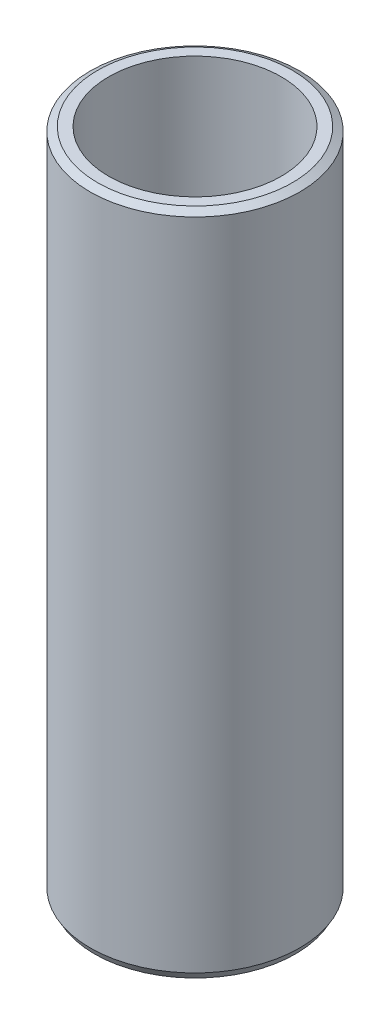
ISO-10303-21;
HEADER;
FILE_DESCRIPTION(('STEP AP214'),'2;1');
FILE_NAME('part.step','',(''),(''),'','','');
FILE_SCHEMA(('AUTOMOTIVE_DESIGN { 1 0 10303 214 1 1 1 1 }'));
ENDSEC;
DATA;
#1=APPLICATION_CONTEXT('core data for automotive mechanical design processes');
#2=APPLICATION_PROTOCOL_DEFINITION('international standard','automotive_design',2000,#1);
#3=PRODUCT_CONTEXT('',#1,'mechanical');
#4=PRODUCT('Part','Part','',(#3));
#5=PRODUCT_RELATED_PRODUCT_CATEGORY('part','',(#4));
#6=PRODUCT_DEFINITION_FORMATION('','',#4);
#7=PRODUCT_DEFINITION_CONTEXT('part definition',#1,'design');
#8=PRODUCT_DEFINITION('design','',#6,#7);
#9=PRODUCT_DEFINITION_SHAPE('','',#8);
#10=(LENGTH_UNIT() NAMED_UNIT(*) SI_UNIT(.MILLI.,.METRE.));
#11=(NAMED_UNIT(*) PLANE_ANGLE_UNIT() SI_UNIT($,.RADIAN.));
#12=(NAMED_UNIT(*) SI_UNIT($,.STERADIAN.) SOLID_ANGLE_UNIT());
#13=UNCERTAINTY_MEASURE_WITH_UNIT(LENGTH_MEASURE(1.E-05),#10,'distance_accuracy_value','');
#14=(GEOMETRIC_REPRESENTATION_CONTEXT(3) GLOBAL_UNCERTAINTY_ASSIGNED_CONTEXT((#13)) GLOBAL_UNIT_ASSIGNED_CONTEXT((#10,
#11,#12)) REPRESENTATION_CONTEXT('',''));
#15=CARTESIAN_POINT('',(0.,0.,0.));
#16=DIRECTION('',(0.,0.,1.));
#17=DIRECTION('',(1.,0.,0.));
#18=AXIS2_PLACEMENT_3D('',#15,#16,#17);
#19=CARTESIAN_POINT('',(0.,254.315129538956,0.));
#20=DIRECTION('',(0.,-1.,0.));
#21=DIRECTION('',(0.,0.,-1.));
#22=AXIS2_PLACEMENT_3D('',#19,#20,#21);
#23=CYLINDRICAL_SURFACE('',#22,40.);
#24=CARTESIAN_POINT('',(0.,252.680123687177,0.));
#25=DIRECTION('',(0.,1.,0.));
#26=DIRECTION('',(0.,0.,1.));
#27=AXIS2_PLACEMENT_3D('',#24,#25,#26);
#28=CIRCLE('',#27,40.);
#29=CARTESIAN_POINT('',(0.,252.680123687177,40.));
#30=VERTEX_POINT('',#29);
#31=EDGE_CURVE('E50',#30,#30,#28,.F.);
#32=ORIENTED_EDGE('',*,*,#31,.T.);
#33=EDGE_LOOP('',(#32));
#34=FACE_BOUND('',#33,.T.);
#35=CARTESIAN_POINT('',(0.,2.83191320595344,0.));
#36=DIRECTION('',(0.,1.,0.));
#37=DIRECTION('',(0.,0.,1.));
#38=AXIS2_PLACEMENT_3D('',#35,#36,#37);
#39=CIRCLE('',#38,40.);
#40=CARTESIAN_POINT('',(0.,2.83191320595344,40.));
#41=VERTEX_POINT('',#40);
#42=EDGE_CURVE('E51',#41,#41,#39,.T.);
#43=ORIENTED_EDGE('',*,*,#42,.T.);
#44=EDGE_LOOP('',(#43));
#45=FACE_BOUND('',#44,.T.);
#46=ADVANCED_FACE('F39',(#34,#45),#23,.T.);
#47=CARTESIAN_POINT('',(0.,254.315129538956,0.));
#48=DIRECTION('',(0.,1.,0.));
#49=DIRECTION('',(0.,0.,1.));
#50=AXIS2_PLACEMENT_3D('',#47,#48,#49);
#51=PLANE('',#50);
#52=CARTESIAN_POINT('',(0.,254.315129538956,0.));
#53=DIRECTION('',(0.,1.,0.));
#54=DIRECTION('',(0.,0.,1.));
#55=AXIS2_PLACEMENT_3D('',#52,#53,#54);
#56=CIRCLE('',#55,37.1680867940465);
#57=CARTESIAN_POINT('',(0.,254.315129538956,37.1680867940465));
#58=VERTEX_POINT('',#57);
#59=EDGE_CURVE('E54',#58,#58,#56,.T.);
#60=ORIENTED_EDGE('',*,*,#59,.T.);
#61=EDGE_LOOP('',(#60));
#62=FACE_BOUND('',#61,.T.);
#63=CARTESIAN_POINT('',(0.,254.315129538956,0.));
#64=DIRECTION('',(0.,1.,0.));
#65=DIRECTION('',(0.,0.,1.));
#66=AXIS2_PLACEMENT_3D('',#63,#64,#65);
#67=CIRCLE('',#66,32.9292470539236);
#68=CARTESIAN_POINT('',(0.,254.315129538956,32.9292470539236));
#69=VERTEX_POINT('',#68);
#70=EDGE_CURVE('E58',#69,#69,#67,.T.);
#71=ORIENTED_EDGE('',*,*,#70,.F.);
#72=EDGE_LOOP('',(#71));
#73=FACE_BOUND('',#72,.T.);
#74=ADVANCED_FACE('F69',(#62,#73),#51,.T.);
#75=CARTESIAN_POINT('',(0.,0.,0.));
#76=DIRECTION('',(0.,1.,0.));
#77=DIRECTION('',(0.,0.,1.));
#78=AXIS2_PLACEMENT_3D('',#75,#76,#77);
#79=PLANE('',#78);
#80=CARTESIAN_POINT('',(0.,0.,0.));
#81=DIRECTION('',(0.,1.,0.));
#82=DIRECTION('',(0.,0.,1.));
#83=AXIS2_PLACEMENT_3D('',#80,#81,#82);
#84=CIRCLE('',#83,38.3649941482211);
#85=CARTESIAN_POINT('',(0.,0.,38.3649941482211));
#86=VERTEX_POINT('',#85);
#87=EDGE_CURVE('E10',#86,#86,#84,.F.);
#88=ORIENTED_EDGE('',*,*,#87,.T.);
#89=EDGE_LOOP('',(#88));
#90=FACE_BOUND('',#89,.T.);
#91=CARTESIAN_POINT('',(0.,0.,0.));
#92=DIRECTION('',(0.,1.,0.));
#93=DIRECTION('',(0.,0.,1.));
#94=AXIS2_PLACEMENT_3D('',#91,#92,#93);
#95=CIRCLE('',#94,32.9292470539236);
#96=CARTESIAN_POINT('',(0.,0.,32.9292470539236));
#97=VERTEX_POINT('',#96);
#98=EDGE_CURVE('E63',#97,#97,#95,.T.);
#99=ORIENTED_EDGE('',*,*,#98,.T.);
#100=EDGE_LOOP('',(#99));
#101=FACE_BOUND('',#100,.T.);
#102=ADVANCED_FACE('F75',(#90,#101),#79,.F.);
#103=CARTESIAN_POINT('',(0.,254.315129538956,0.));
#104=DIRECTION('',(0.,-1.,0.));
#105=DIRECTION('',(0.,0.,-1.));
#106=AXIS2_PLACEMENT_3D('',#103,#104,#105);
#107=CYLINDRICAL_SURFACE('',#106,32.9292470539236);
#108=ORIENTED_EDGE('',*,*,#70,.T.);
#109=EDGE_LOOP('',(#108));
#110=FACE_BOUND('',#109,.T.);
#111=ORIENTED_EDGE('',*,*,#98,.F.);
#112=EDGE_LOOP('',(#111));
#113=FACE_BOUND('',#112,.T.);
#114=ADVANCED_FACE('F70',(#110,#113),#107,.F.);
#115=CARTESIAN_POINT('',(0.,254.315129538956,0.));
#116=DIRECTION('',(0.,-1.,0.));
#117=DIRECTION('',(0.,0.,-1.));
#118=AXIS2_PLACEMENT_3D('',#115,#116,#117);
#119=CONICAL_SURFACE('',#118,37.1680867940465,1.0471975511966);
#120=ORIENTED_EDGE('',*,*,#31,.F.);
#121=EDGE_LOOP('',(#120));
#122=FACE_BOUND('',#121,.T.);
#123=ORIENTED_EDGE('',*,*,#59,.F.);
#124=EDGE_LOOP('',(#123));
#125=FACE_BOUND('',#124,.T.);
#126=ADVANCED_FACE('F81',(#122,#125),#119,.T.);
#127=CARTESIAN_POINT('',(0.,2.83191320595344,0.));
#128=DIRECTION('',(0.,1.,0.));
#129=DIRECTION('',(0.,0.,1.));
#130=AXIS2_PLACEMENT_3D('',#127,#128,#129);
#131=CONICAL_SURFACE('',#130,40.,0.523598775598305);
#132=ORIENTED_EDGE('',*,*,#87,.F.);
#133=EDGE_LOOP('',(#132));
#134=FACE_BOUND('',#133,.T.);
#135=ORIENTED_EDGE('',*,*,#42,.F.);
#136=EDGE_LOOP('',(#135));
#137=FACE_BOUND('',#136,.T.);
#138=ADVANCED_FACE('F45',(#134,#137),#131,.T.);
#139=CLOSED_SHELL('',(#46,#74,#102,#114,#126,#138));
#140=MANIFOLD_SOLID_BREP('B2',#139);
#141=ADVANCED_BREP_SHAPE_REPRESENTATION('',(#18,#140),#14);
#142=SHAPE_DEFINITION_REPRESENTATION(#9,#141);
ENDSEC;
END-ISO-10303-21;
